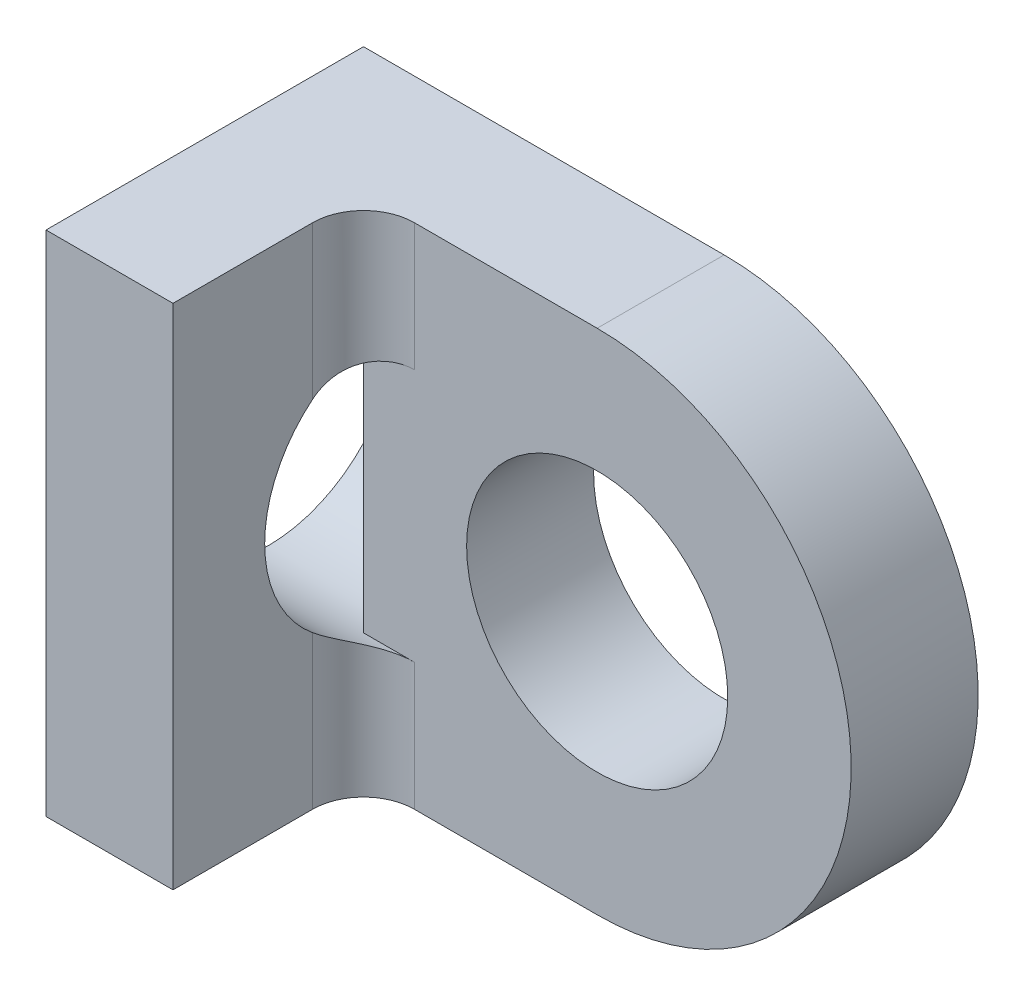
ISO-10303-21;
HEADER;
FILE_DESCRIPTION(('STEP AP214'),'2;1');
FILE_NAME('part.step','',(''),(''),'','','');
FILE_SCHEMA(('AUTOMOTIVE_DESIGN { 1 0 10303 214 1 1 1 1 }'));
ENDSEC;
DATA;
#1=APPLICATION_CONTEXT('core data for automotive mechanical design processes');
#2=APPLICATION_PROTOCOL_DEFINITION('international standard','automotive_design',2000,#1);
#3=PRODUCT_CONTEXT('',#1,'mechanical');
#4=PRODUCT('Part','Part','',(#3));
#5=PRODUCT_RELATED_PRODUCT_CATEGORY('part','',(#4));
#6=PRODUCT_DEFINITION_FORMATION('','',#4);
#7=PRODUCT_DEFINITION_CONTEXT('part definition',#1,'design');
#8=PRODUCT_DEFINITION('design','',#6,#7);
#9=PRODUCT_DEFINITION_SHAPE('','',#8);
#10=(LENGTH_UNIT() NAMED_UNIT(*) SI_UNIT(.MILLI.,.METRE.));
#11=(NAMED_UNIT(*) PLANE_ANGLE_UNIT() SI_UNIT($,.RADIAN.));
#12=(NAMED_UNIT(*) SI_UNIT($,.STERADIAN.) SOLID_ANGLE_UNIT());
#13=UNCERTAINTY_MEASURE_WITH_UNIT(LENGTH_MEASURE(1.E-05),#10,'distance_accuracy_value','');
#14=(GEOMETRIC_REPRESENTATION_CONTEXT(3) GLOBAL_UNCERTAINTY_ASSIGNED_CONTEXT((#13)) GLOBAL_UNIT_ASSIGNED_CONTEXT((#10,
#11,#12)) REPRESENTATION_CONTEXT('',''));
#15=CARTESIAN_POINT('',(0.,0.,0.));
#16=DIRECTION('',(0.,0.,1.));
#17=DIRECTION('',(1.,0.,0.));
#18=AXIS2_PLACEMENT_3D('',#15,#16,#17);
#19=CARTESIAN_POINT('',(0.,0.,3.175));
#20=DIRECTION('',(0.,0.,-1.));
#21=DIRECTION('',(-1.,0.,0.));
#22=AXIS2_PLACEMENT_3D('',#19,#20,#21);
#23=CYLINDRICAL_SURFACE('',#22,6.35);
#24=CARTESIAN_POINT('',(0.,0.,0.));
#25=DIRECTION('',(0.,0.,1.));
#26=DIRECTION('',(1.,0.,0.));
#27=AXIS2_PLACEMENT_3D('',#24,#25,#26);
#28=CIRCLE('',#27,6.35);
#29=CARTESIAN_POINT('',(0.,6.35,0.));
#30=VERTEX_POINT('',#29);
#31=CARTESIAN_POINT('',(0.,-6.35,0.));
#32=VERTEX_POINT('',#31);
#33=EDGE_CURVE('E200',#30,#32,#28,.F.);
#34=ORIENTED_EDGE('',*,*,#33,.F.);
#35=DIRECTION('',(0.,0.,-1.));
#36=VECTOR('',#35,1.);
#37=CARTESIAN_POINT('',(0.,6.35,3.175));
#38=LINE('',#37,#36);
#39=CARTESIAN_POINT('',(0.,6.35,3.175));
#40=VERTEX_POINT('',#39);
#41=EDGE_CURVE('E151',#40,#30,#38,.T.);
#42=ORIENTED_EDGE('',*,*,#41,.F.);
#43=CARTESIAN_POINT('',(0.,0.,3.175));
#44=DIRECTION('',(0.,0.,1.));
#45=DIRECTION('',(1.,0.,0.));
#46=AXIS2_PLACEMENT_3D('',#43,#44,#45);
#47=CIRCLE('',#46,6.35);
#48=CARTESIAN_POINT('',(0.,-6.35,3.175));
#49=VERTEX_POINT('',#48);
#50=EDGE_CURVE('E201',#40,#49,#47,.F.);
#51=ORIENTED_EDGE('',*,*,#50,.T.);
#52=DIRECTION('',(0.,0.,-1.));
#53=VECTOR('',#52,1.);
#54=CARTESIAN_POINT('',(0.,-6.35,3.175));
#55=LINE('',#54,#53);
#56=EDGE_CURVE('E216',#49,#32,#55,.T.);
#57=ORIENTED_EDGE('',*,*,#56,.T.);
#58=EDGE_LOOP('',(#34,#42,#51,#57));
#59=FACE_BOUND('',#58,.T.);
#60=ADVANCED_FACE('F45',(#59),#23,.T.);
#61=CARTESIAN_POINT('',(0.,6.35,3.175));
#62=DIRECTION('',(0.,1.,0.));
#63=DIRECTION('',(0.,0.,1.));
#64=AXIS2_PLACEMENT_3D('',#61,#62,#63);
#65=PLANE('',#64);
#66=DIRECTION('',(1.,0.,0.));
#67=VECTOR('',#66,1.);
#68=CARTESIAN_POINT('',(0.,6.35,0.));
#69=LINE('',#68,#67);
#70=CARTESIAN_POINT('',(-9.017,6.35,0.));
#71=VERTEX_POINT('',#70);
#72=EDGE_CURVE('E220',#71,#30,#69,.T.);
#73=ORIENTED_EDGE('',*,*,#72,.F.);
#74=DIRECTION('',(0.,0.,-1.));
#75=VECTOR('',#74,1.);
#76=CARTESIAN_POINT('',(-9.017,6.35,3.175));
#77=LINE('',#76,#75);
#78=CARTESIAN_POINT('',(-9.017,6.35,7.9375));
#79=VERTEX_POINT('',#78);
#80=EDGE_CURVE('E239',#79,#71,#77,.T.);
#81=ORIENTED_EDGE('',*,*,#80,.F.);
#82=DIRECTION('',(-1.,0.,0.));
#83=VECTOR('',#82,1.);
#84=CARTESIAN_POINT('',(-9.017,6.35,7.9375));
#85=LINE('',#84,#83);
#86=CARTESIAN_POINT('',(-5.842,6.35,7.9375));
#87=VERTEX_POINT('',#86);
#88=EDGE_CURVE('E186',#87,#79,#85,.T.);
#89=ORIENTED_EDGE('',*,*,#88,.F.);
#90=DIRECTION('',(0.,0.,-1.));
#91=VECTOR('',#90,1.);
#92=CARTESIAN_POINT('',(-5.842,6.35,7.9375));
#93=LINE('',#92,#91);
#94=CARTESIAN_POINT('',(-5.842,6.35,4.445));
#95=VERTEX_POINT('',#94);
#96=EDGE_CURVE('E190',#87,#95,#93,.T.);
#97=ORIENTED_EDGE('',*,*,#96,.T.);
#98=CARTESIAN_POINT('',(-4.572,6.35,4.445));
#99=DIRECTION('',(0.,1.,0.));
#100=DIRECTION('',(0.,0.,1.));
#101=AXIS2_PLACEMENT_3D('',#98,#99,#100);
#102=CIRCLE('',#101,1.27);
#103=CARTESIAN_POINT('',(-4.572,6.35,3.175));
#104=VERTEX_POINT('',#103);
#105=EDGE_CURVE('E60',#95,#104,#102,.F.);
#106=ORIENTED_EDGE('',*,*,#105,.T.);
#107=DIRECTION('',(1.,0.,0.));
#108=VECTOR('',#107,1.);
#109=CARTESIAN_POINT('',(0.,6.35,3.175));
#110=LINE('',#109,#108);
#111=EDGE_CURVE('E205',#104,#40,#110,.T.);
#112=ORIENTED_EDGE('',*,*,#111,.T.);
#113=ORIENTED_EDGE('',*,*,#41,.T.);
#114=EDGE_LOOP('',(#73,#81,#89,#97,#106,#112,#113));
#115=FACE_BOUND('',#114,.T.);
#116=ADVANCED_FACE('F281',(#115),#65,.T.);
#117=CARTESIAN_POINT('',(-9.017,0.,3.175));
#118=DIRECTION('',(-1.,0.,0.));
#119=DIRECTION('',(0.,-1.,0.));
#120=AXIS2_PLACEMENT_3D('',#117,#118,#119);
#121=PLANE('',#120);
#122=CARTESIAN_POINT('',(-9.017,0.,2.38125));
#123=DIRECTION('',(-1.,0.,0.));
#124=DIRECTION('',(0.,-1.,0.));
#125=AXIS2_PLACEMENT_3D('',#122,#123,#124);
#126=CIRCLE('',#125,3.2639);
#127=CARTESIAN_POINT('',(-9.017,-2.23219435701733,0.));
#128=VERTEX_POINT('',#127);
#129=CARTESIAN_POINT('',(-9.017,2.23219435701733,0.));
#130=VERTEX_POINT('',#129);
#131=EDGE_CURVE('E157',#128,#130,#126,.T.);
#132=ORIENTED_EDGE('',*,*,#131,.F.);
#133=DIRECTION('',(0.,1.,0.));
#134=VECTOR('',#133,1.);
#135=CARTESIAN_POINT('',(-9.017,0.,0.));
#136=LINE('',#135,#134);
#137=CARTESIAN_POINT('',(-9.017,-6.35,0.));
#138=VERTEX_POINT('',#137);
#139=EDGE_CURVE('E165',#138,#128,#136,.T.);
#140=ORIENTED_EDGE('',*,*,#139,.F.);
#141=DIRECTION('',(0.,0.,-1.));
#142=VECTOR('',#141,1.);
#143=CARTESIAN_POINT('',(-9.017,-6.35,3.175));
#144=LINE('',#143,#142);
#145=CARTESIAN_POINT('',(-9.017,-6.35,7.9375));
#146=VERTEX_POINT('',#145);
#147=EDGE_CURVE('E236',#146,#138,#144,.T.);
#148=ORIENTED_EDGE('',*,*,#147,.F.);
#149=DIRECTION('',(0.,-1.,0.));
#150=VECTOR('',#149,1.);
#151=CARTESIAN_POINT('',(-9.017,6.35,7.9375));
#152=LINE('',#151,#150);
#153=EDGE_CURVE('E176',#79,#146,#152,.T.);
#154=ORIENTED_EDGE('',*,*,#153,.F.);
#155=ORIENTED_EDGE('',*,*,#80,.T.);
#156=EDGE_CURVE('E224',#130,#71,#136,.T.);
#157=ORIENTED_EDGE('',*,*,#156,.F.);
#158=EDGE_LOOP('',(#132,#140,#148,#154,#155,#157));
#159=FACE_BOUND('',#158,.T.);
#160=ADVANCED_FACE('F285',(#159),#121,.T.);
#161=CARTESIAN_POINT('',(0.,-6.35,3.175));
#162=DIRECTION('',(0.,1.,0.));
#163=DIRECTION('',(-1.,0.,0.));
#164=AXIS2_PLACEMENT_3D('',#161,#162,#163);
#165=PLANE('',#164);
#166=DIRECTION('',(1.,0.,0.));
#167=VECTOR('',#166,1.);
#168=CARTESIAN_POINT('',(0.,-6.35,0.));
#169=LINE('',#168,#167);
#170=EDGE_CURVE('E227',#138,#32,#169,.T.);
#171=ORIENTED_EDGE('',*,*,#170,.T.);
#172=ORIENTED_EDGE('',*,*,#56,.F.);
#173=DIRECTION('',(1.,0.,0.));
#174=VECTOR('',#173,1.);
#175=CARTESIAN_POINT('',(0.,-6.35,3.175));
#176=LINE('',#175,#174);
#177=CARTESIAN_POINT('',(-4.572,-6.35,3.175));
#178=VERTEX_POINT('',#177);
#179=EDGE_CURVE('E209',#178,#49,#176,.T.);
#180=ORIENTED_EDGE('',*,*,#179,.F.);
#181=CARTESIAN_POINT('',(-4.572,-6.35,4.445));
#182=DIRECTION('',(0.,1.,0.));
#183=DIRECTION('',(-1.,0.,0.));
#184=AXIS2_PLACEMENT_3D('',#181,#182,#183);
#185=CIRCLE('',#184,1.27);
#186=CARTESIAN_POINT('',(-5.842,-6.35,4.445));
#187=VERTEX_POINT('',#186);
#188=EDGE_CURVE('E270',#178,#187,#185,.T.);
#189=ORIENTED_EDGE('',*,*,#188,.T.);
#190=DIRECTION('',(0.,0.,-1.));
#191=VECTOR('',#190,1.);
#192=CARTESIAN_POINT('',(-5.842,-6.35,7.9375));
#193=LINE('',#192,#191);
#194=CARTESIAN_POINT('',(-5.842,-6.35,7.9375));
#195=VERTEX_POINT('',#194);
#196=EDGE_CURVE('E196',#195,#187,#193,.T.);
#197=ORIENTED_EDGE('',*,*,#196,.F.);
#198=DIRECTION('',(1.,0.,0.));
#199=VECTOR('',#198,1.);
#200=CARTESIAN_POINT('',(-9.017,-6.35,7.9375));
#201=LINE('',#200,#199);
#202=EDGE_CURVE('E180',#146,#195,#201,.T.);
#203=ORIENTED_EDGE('',*,*,#202,.F.);
#204=ORIENTED_EDGE('',*,*,#147,.T.);
#205=EDGE_LOOP('',(#171,#172,#180,#189,#197,#203,#204));
#206=FACE_BOUND('',#205,.T.);
#207=ADVANCED_FACE('F289',(#206),#165,.F.);
#208=CARTESIAN_POINT('',(0.,0.,3.175));
#209=DIRECTION('',(0.,0.,-1.));
#210=DIRECTION('',(-1.,0.,0.));
#211=AXIS2_PLACEMENT_3D('',#208,#209,#210);
#212=CYLINDRICAL_SURFACE('',#211,3.2639);
#213=CARTESIAN_POINT('',(0.,0.,3.175));
#214=DIRECTION('',(0.,0.,1.));
#215=DIRECTION('',(1.,0.,0.));
#216=AXIS2_PLACEMENT_3D('',#213,#214,#215);
#217=CIRCLE('',#216,3.2639);
#218=CARTESIAN_POINT('',(3.2639,0.,3.175));
#219=VERTEX_POINT('',#218);
#220=EDGE_CURVE('E212',#219,#219,#217,.T.);
#221=ORIENTED_EDGE('',*,*,#220,.T.);
#222=EDGE_LOOP('',(#221));
#223=FACE_BOUND('',#222,.T.);
#224=CARTESIAN_POINT('',(0.,0.,0.));
#225=DIRECTION('',(0.,0.,1.));
#226=DIRECTION('',(1.,0.,0.));
#227=AXIS2_PLACEMENT_3D('',#224,#225,#226);
#228=CIRCLE('',#227,3.2639);
#229=CARTESIAN_POINT('',(3.2639,0.,0.));
#230=VERTEX_POINT('',#229);
#231=EDGE_CURVE('E206',#230,#230,#228,.T.);
#232=ORIENTED_EDGE('',*,*,#231,.F.);
#233=EDGE_LOOP('',(#232));
#234=FACE_BOUND('',#233,.T.);
#235=ADVANCED_FACE('F293',(#223,#234),#212,.F.);
#236=CARTESIAN_POINT('',(0.,0.,3.175));
#237=DIRECTION('',(0.,0.,1.));
#238=DIRECTION('',(1.,0.,0.));
#239=AXIS2_PLACEMENT_3D('',#236,#237,#238);
#240=PLANE('',#239);
#241=DIRECTION('',(0.,1.,0.));
#242=VECTOR('',#241,1.);
#243=CARTESIAN_POINT('',(-5.842,6.35,3.175));
#244=LINE('',#243,#242);
#245=CARTESIAN_POINT('',(-5.842,-3.16591284584715,3.175));
#246=VERTEX_POINT('',#245);
#247=CARTESIAN_POINT('',(-5.842,3.16591284584715,3.175));
#248=VERTEX_POINT('',#247);
#249=EDGE_CURVE('E171',#246,#248,#244,.T.);
#250=ORIENTED_EDGE('',*,*,#249,.F.);
#251=DIRECTION('',(-1.,0.,0.));
#252=VECTOR('',#251,1.);
#253=CARTESIAN_POINT('',(-5.842,-3.16591284584715,3.175));
#254=LINE('',#253,#252);
#255=CARTESIAN_POINT('',(-4.572,-3.16591284584715,3.175));
#256=VERTEX_POINT('',#255);
#257=EDGE_CURVE('E67',#246,#256,#254,.F.);
#258=ORIENTED_EDGE('',*,*,#257,.T.);
#259=DIRECTION('',(0.,1.,0.));
#260=VECTOR('',#259,1.);
#261=CARTESIAN_POINT('',(-4.572,0.,3.175));
#262=LINE('',#261,#260);
#263=EDGE_CURVE('E259',#256,#178,#262,.F.);
#264=ORIENTED_EDGE('',*,*,#263,.T.);
#265=ORIENTED_EDGE('',*,*,#179,.T.);
#266=ORIENTED_EDGE('',*,*,#50,.F.);
#267=ORIENTED_EDGE('',*,*,#111,.F.);
#268=DIRECTION('',(0.,1.,0.));
#269=VECTOR('',#268,1.);
#270=CARTESIAN_POINT('',(-4.572,0.,3.175));
#271=LINE('',#270,#269);
#272=CARTESIAN_POINT('',(-4.572,3.16591284584715,3.175));
#273=VERTEX_POINT('',#272);
#274=EDGE_CURVE('E255',#104,#273,#271,.F.);
#275=ORIENTED_EDGE('',*,*,#274,.T.);
#276=DIRECTION('',(-1.,0.,0.));
#277=VECTOR('',#276,1.);
#278=CARTESIAN_POINT('',(-4.572,3.16591284584715,3.175));
#279=LINE('',#278,#277);
#280=EDGE_CURVE('E252',#273,#248,#279,.T.);
#281=ORIENTED_EDGE('',*,*,#280,.T.);
#282=EDGE_LOOP('',(#250,#258,#264,#265,#266,#267,#275,#281));
#283=FACE_BOUND('',#282,.T.);
#284=ORIENTED_EDGE('',*,*,#220,.F.);
#285=EDGE_LOOP('',(#284));
#286=FACE_BOUND('',#285,.T.);
#287=ADVANCED_FACE('F297',(#283,#286),#240,.T.);
#288=CARTESIAN_POINT('',(0.,0.,0.));
#289=DIRECTION('',(0.,0.,1.));
#290=DIRECTION('',(1.,0.,0.));
#291=AXIS2_PLACEMENT_3D('',#288,#289,#290);
#292=PLANE('',#291);
#293=DIRECTION('',(0.,-1.,0.));
#294=VECTOR('',#293,1.);
#295=CARTESIAN_POINT('',(-5.842,0.,0.));
#296=LINE('',#295,#294);
#297=CARTESIAN_POINT('',(-5.842,2.23219435701733,0.));
#298=VERTEX_POINT('',#297);
#299=CARTESIAN_POINT('',(-5.842,-2.23219435701733,0.));
#300=VERTEX_POINT('',#299);
#301=EDGE_CURVE('E139',#298,#300,#296,.T.);
#302=ORIENTED_EDGE('',*,*,#301,.F.);
#303=DIRECTION('',(-1.,0.,0.));
#304=VECTOR('',#303,1.);
#305=CARTESIAN_POINT('',(-5.842,2.23219435701733,0.));
#306=LINE('',#305,#304);
#307=EDGE_CURVE('E167',#298,#130,#306,.T.);
#308=ORIENTED_EDGE('',*,*,#307,.T.);
#309=ORIENTED_EDGE('',*,*,#156,.T.);
#310=ORIENTED_EDGE('',*,*,#72,.T.);
#311=ORIENTED_EDGE('',*,*,#33,.T.);
#312=ORIENTED_EDGE('',*,*,#170,.F.);
#313=ORIENTED_EDGE('',*,*,#139,.T.);
#314=DIRECTION('',(-1.,0.,0.));
#315=VECTOR('',#314,1.);
#316=CARTESIAN_POINT('',(-5.842,-2.23219435701733,0.));
#317=LINE('',#316,#315);
#318=EDGE_CURVE('E154',#128,#300,#317,.F.);
#319=ORIENTED_EDGE('',*,*,#318,.T.);
#320=EDGE_LOOP('',(#302,#308,#309,#310,#311,#312,#313,#319));
#321=FACE_BOUND('',#320,.T.);
#322=ORIENTED_EDGE('',*,*,#231,.T.);
#323=EDGE_LOOP('',(#322));
#324=FACE_BOUND('',#323,.T.);
#325=ADVANCED_FACE('F161',(#321,#324),#292,.F.);
#326=CARTESIAN_POINT('',(-5.842,6.35,7.9375));
#327=DIRECTION('',(-1.,0.,0.));
#328=DIRECTION('',(0.,-1.,0.));
#329=AXIS2_PLACEMENT_3D('',#326,#327,#328);
#330=PLANE('',#329);
#331=ORIENTED_EDGE('',*,*,#196,.T.);
#332=DIRECTION('',(0.,1.,0.));
#333=VECTOR('',#332,1.);
#334=CARTESIAN_POINT('',(-5.842,6.35,4.445));
#335=LINE('',#334,#333);
#336=CARTESIAN_POINT('',(-5.842,-2.52863187267344,4.445));
#337=VERTEX_POINT('',#336);
#338=EDGE_CURVE('E248',#187,#337,#335,.T.);
#339=ORIENTED_EDGE('',*,*,#338,.T.);
#340=CARTESIAN_POINT('',(-5.842,0.,2.38125));
#341=DIRECTION('',(-1.,0.,0.));
#342=DIRECTION('',(0.,-1.,0.));
#343=AXIS2_PLACEMENT_3D('',#340,#341,#342);
#344=CIRCLE('',#343,3.2639);
#345=CARTESIAN_POINT('',(-5.842,2.52863187267344,4.445));
#346=VERTEX_POINT('',#345);
#347=EDGE_CURVE('E159',#337,#346,#344,.T.);
#348=ORIENTED_EDGE('',*,*,#347,.T.);
#349=DIRECTION('',(0.,1.,0.));
#350=VECTOR('',#349,1.);
#351=CARTESIAN_POINT('',(-5.842,6.35,4.445));
#352=LINE('',#351,#350);
#353=EDGE_CURVE('E150',#346,#95,#352,.T.);
#354=ORIENTED_EDGE('',*,*,#353,.T.);
#355=ORIENTED_EDGE('',*,*,#96,.F.);
#356=DIRECTION('',(0.,1.,0.));
#357=VECTOR('',#356,1.);
#358=CARTESIAN_POINT('',(-5.842,6.35,7.9375));
#359=LINE('',#358,#357);
#360=EDGE_CURVE('E183',#195,#87,#359,.T.);
#361=ORIENTED_EDGE('',*,*,#360,.F.);
#362=EDGE_LOOP('',(#331,#339,#348,#354,#355,#361));
#363=FACE_BOUND('',#362,.T.);
#364=ADVANCED_FACE('F301',(#363),#330,.F.);
#365=CARTESIAN_POINT('',(0.,0.,7.9375));
#366=DIRECTION('',(0.,0.,1.));
#367=DIRECTION('',(1.,0.,0.));
#368=AXIS2_PLACEMENT_3D('',#365,#366,#367);
#369=PLANE('',#368);
#370=ORIENTED_EDGE('',*,*,#153,.T.);
#371=ORIENTED_EDGE('',*,*,#202,.T.);
#372=ORIENTED_EDGE('',*,*,#360,.T.);
#373=ORIENTED_EDGE('',*,*,#88,.T.);
#374=EDGE_LOOP('',(#370,#371,#372,#373));
#375=FACE_BOUND('',#374,.T.);
#376=ADVANCED_FACE('F306',(#375),#369,.T.);
#377=CARTESIAN_POINT('',(-5.842,0.,2.38125));
#378=DIRECTION('',(-1.,0.,0.));
#379=DIRECTION('',(0.,-1.,0.));
#380=AXIS2_PLACEMENT_3D('',#377,#378,#379);
#381=PLANE('',#380);
#382=EDGE_CURVE('E144',#248,#298,#344,.T.);
#383=ORIENTED_EDGE('',*,*,#382,.T.);
#384=ORIENTED_EDGE('',*,*,#301,.T.);
#385=EDGE_CURVE('E142',#300,#246,#344,.T.);
#386=ORIENTED_EDGE('',*,*,#385,.T.);
#387=ORIENTED_EDGE('',*,*,#249,.T.);
#388=EDGE_LOOP('',(#383,#384,#386,#387));
#389=FACE_BOUND('',#388,.T.);
#390=ADVANCED_FACE('F140',(#389),#381,.T.);
#391=CARTESIAN_POINT('',(-5.842,0.,2.38125));
#392=DIRECTION('',(-1.,0.,0.));
#393=DIRECTION('',(0.,-1.,0.));
#394=AXIS2_PLACEMENT_3D('',#391,#392,#393);
#395=CYLINDRICAL_SURFACE('',#394,3.2639);
#396=ORIENTED_EDGE('',*,*,#382,.F.);
#397=ORIENTED_EDGE('',*,*,#280,.F.);
#398=CARTESIAN_POINT('',(-4.572,3.16591284584715,3.175));
#399=CARTESIAN_POINT('',(-4.60652378137574,3.16590967345986,3.17499980341934));
#400=CARTESIAN_POINT('',(-4.64103116962773,3.16556002349899,3.17640871766874));
#401=CARTESIAN_POINT('',(-4.70980183778773,3.16414483019907,3.18202652767695));
#402=CARTESIAN_POINT('',(-4.74406512168269,3.16307929857977,3.1862353775978));
#403=CARTESIAN_POINT('',(-4.84607614627273,3.15877856464334,3.20301851703984));
#404=CARTESIAN_POINT('',(-4.91314505564818,3.15443934245196,3.21974951132308));
#405=CARTESIAN_POINT('',(-5.04343798989839,3.14241538251698,3.26373666067669));
#406=CARTESIAN_POINT('',(-5.10665933024619,3.13472833875149,3.29100006914257));
#407=CARTESIAN_POINT('',(-5.227417554303,3.11542500177566,3.35504872566791));
#408=CARTESIAN_POINT('',(-5.28495591042071,3.1038097298016,3.3918314983595));
#409=CARTESIAN_POINT('',(-5.39242723341171,3.07610668977133,3.47323979207981));
#410=CARTESIAN_POINT('',(-5.44240189396956,3.06004493310334,3.51781916176944));
#411=CARTESIAN_POINT('',(-5.53387990054457,3.0229423222676,3.61310624443134));
#412=CARTESIAN_POINT('',(-5.57538766754953,3.00190407902965,3.66381073703526));
#413=CARTESIAN_POINT('',(-5.64943096066113,2.95449319385387,3.76955136799892));
#414=CARTESIAN_POINT('',(-5.68191878031267,2.92809342085117,3.8246086309108));
#415=CARTESIAN_POINT('',(-5.73756413380416,2.87008533355559,3.93677383004955));
#416=CARTESIAN_POINT('',(-5.76070235769753,2.83846642772948,3.99388574771149));
#417=CARTESIAN_POINT('',(-5.8012992372893,2.76437640404735,4.11830937158994));
#418=CARTESIAN_POINT('',(-5.81702553845256,2.72097508754173,4.18563561029698));
#419=CARTESIAN_POINT('',(-5.8322835963155,2.65172417844808,4.28467731640897));
#420=CARTESIAN_POINT('',(-5.83598162609375,2.62798236645842,4.31732571348605));
#421=CARTESIAN_POINT('',(-5.84083683695898,2.57923401338382,4.3818061488621));
#422=CARTESIAN_POINT('',(-5.84199673224005,2.55422885259551,4.41363902320326));
#423=CARTESIAN_POINT('',(-5.842,2.52863187267344,4.445));
#424=B_SPLINE_CURVE_WITH_KNOTS('',3,(#398,#399,#400,#401,#402,#403,#404,#405,#406,#407,#408,
#409,#410,#411,#412,#413,#414,#415,#416,#417,#418,#419,#420,#421,#422,#423),.UNSPECIFIED.,.F.,
.F.,(4,2,2,2,2,2,2,2,2,2,2,2,4),(0.,0.103508185616759,0.207014676734778,0.41373146525905,
0.620590868688051,0.827396535385934,1.03301708785067,1.23852999916992,1.44511001354057,
1.65211452828267,1.89579127187884,2.01731628404086,2.13871127787983),.UNSPECIFIED.);
#425=EDGE_CURVE('E11',#273,#346,#424,.T.);
#426=ORIENTED_EDGE('',*,*,#425,.T.);
#427=ORIENTED_EDGE('',*,*,#347,.F.);
#428=CARTESIAN_POINT('',(-5.842,-2.52863187267344,4.445));
#429=CARTESIAN_POINT('',(-5.84200094122572,-2.55546730329444,4.41212888374624));
#430=CARTESIAN_POINT('',(-5.84072315760883,-2.58166207334218,4.37871541426735));
#431=CARTESIAN_POINT('',(-5.83536849338425,-2.63265590145182,4.31100508875061));
#432=CARTESIAN_POINT('',(-5.83128862426034,-2.65745343873557,4.27670732721185));
#433=CARTESIAN_POINT('',(-5.82005006248699,-2.70563933874812,4.20727205301955));
#434=CARTESIAN_POINT('',(-5.81287117982557,-2.72901729347217,4.17213048595075));
#435=CARTESIAN_POINT('',(-5.79523014335312,-2.77402982834034,4.10158656960827));
#436=CARTESIAN_POINT('',(-5.78476907990536,-2.79566498445889,4.06618431074675));
#437=CARTESIAN_POINT('',(-5.74799252573338,-2.85806764662791,3.95962028342269));
#438=CARTESIAN_POINT('',(-5.71634667812455,-2.89603638571824,3.88853154579829));
#439=CARTESIAN_POINT('',(-5.63844925737923,-2.96362023746013,3.75087600006034));
#440=CARTESIAN_POINT('',(-5.59225417399634,-2.99326683402989,3.68429289281916));
#441=CARTESIAN_POINT('',(-5.49389172028893,-3.04078117665486,3.56869467255135));
#442=CARTESIAN_POINT('',(-5.44358789760382,-3.05973779020151,3.51853459014146));
#443=CARTESIAN_POINT('',(-5.33421079239961,-3.09233950625069,3.42665132225491));
#444=CARTESIAN_POINT('',(-5.27513128522676,-3.10598081348086,3.38493417543958));
#445=CARTESIAN_POINT('',(-5.1539979419883,-3.12794051723829,3.31416141927766));
#446=CARTESIAN_POINT('',(-5.09235819633162,-3.13653740461858,3.28447928458016));
#447=CARTESIAN_POINT('',(-4.96480296992206,-3.15027315330413,3.23534420338374));
#448=CARTESIAN_POINT('',(-4.89889132643321,-3.15541507212403,3.21588221578819));
#449=CARTESIAN_POINT('',(-4.78912209933828,-3.16137520906575,3.19293569510297));
#450=CARTESIAN_POINT('',(-4.74595925378605,-3.1630857318976,3.18621474861594));
#451=CARTESIAN_POINT('',(-4.65920358858514,-3.16534956983907,3.1772473104468));
#452=CARTESIAN_POINT('',(-4.61561147155197,-3.1659045351935,3.1749944381533));
#453=CARTESIAN_POINT('',(-4.572,-3.16591284584715,3.175));
#454=B_SPLINE_CURVE_WITH_KNOTS('',3,(#428,#429,#430,#431,#432,#433,#434,#435,#436,#437,#438,
#439,#440,#441,#442,#443,#444,#445,#446,#447,#448,#449,#450,#451,#452,#453),.UNSPECIFIED.,.F.,
.F.,(4,2,2,2,2,2,2,2,2,2,2,2,4),(0.,0.127296286616028,0.254728550162248,0.383003867537165,
0.511236616000538,0.76925749277211,1.02628866184316,1.24570223480832,1.46527218915284,
1.67117387871209,1.87689311233821,2.0078148357597,2.13854946204929),.UNSPECIFIED.);
#455=EDGE_CURVE('E72',#337,#256,#454,.T.);
#456=ORIENTED_EDGE('',*,*,#455,.T.);
#457=ORIENTED_EDGE('',*,*,#257,.F.);
#458=ORIENTED_EDGE('',*,*,#385,.F.);
#459=ORIENTED_EDGE('',*,*,#318,.F.);
#460=ORIENTED_EDGE('',*,*,#131,.T.);
#461=ORIENTED_EDGE('',*,*,#307,.F.);
#462=EDGE_LOOP('',(#396,#397,#426,#427,#456,#457,#458,#459,#460,#461));
#463=FACE_BOUND('',#462,.T.);
#464=ADVANCED_FACE('F153',(#463),#395,.F.);
#465=CARTESIAN_POINT('',(-4.572,6.35,4.445));
#466=DIRECTION('',(0.,1.,0.));
#467=DIRECTION('',(-1.,0.,0.));
#468=AXIS2_PLACEMENT_3D('',#465,#466,#467);
#469=CYLINDRICAL_SURFACE('',#468,1.27);
#470=ORIENTED_EDGE('',*,*,#188,.F.);
#471=ORIENTED_EDGE('',*,*,#263,.F.);
#472=ORIENTED_EDGE('',*,*,#455,.F.);
#473=ORIENTED_EDGE('',*,*,#338,.F.);
#474=EDGE_LOOP('',(#470,#471,#472,#473));
#475=FACE_BOUND('',#474,.T.);
#476=ADVANCED_FACE('F274',(#475),#469,.F.);
#477=CARTESIAN_POINT('',(-4.572,6.35,4.445));
#478=DIRECTION('',(0.,1.,0.));
#479=DIRECTION('',(-1.,0.,0.));
#480=AXIS2_PLACEMENT_3D('',#477,#478,#479);
#481=CYLINDRICAL_SURFACE('',#480,1.27);
#482=ORIENTED_EDGE('',*,*,#425,.F.);
#483=ORIENTED_EDGE('',*,*,#274,.F.);
#484=ORIENTED_EDGE('',*,*,#105,.F.);
#485=ORIENTED_EDGE('',*,*,#353,.F.);
#486=EDGE_LOOP('',(#482,#483,#484,#485));
#487=FACE_BOUND('',#486,.T.);
#488=ADVANCED_FACE('F47',(#487),#481,.F.);
#489=CLOSED_SHELL('',(#60,#116,#160,#207,#235,#287,#325,#364,#376,#390,#464,#476,#488));
#490=MANIFOLD_SOLID_BREP('B2',#489);
#491=ADVANCED_BREP_SHAPE_REPRESENTATION('',(#18,#490),#14);
#492=SHAPE_DEFINITION_REPRESENTATION(#9,#491);
ENDSEC;
END-ISO-10303-21;
